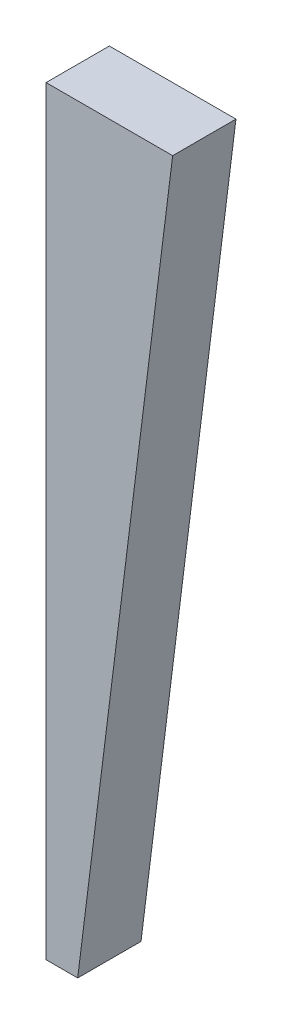
ISO-10303-21;
HEADER;
FILE_DESCRIPTION(('STEP AP214'),'2;1');
FILE_NAME('part.step','',(''),(''),'','','');
FILE_SCHEMA(('AUTOMOTIVE_DESIGN { 1 0 10303 214 1 1 1 1 }'));
ENDSEC;
DATA;
#1=APPLICATION_CONTEXT('core data for automotive mechanical design processes');
#2=APPLICATION_PROTOCOL_DEFINITION('international standard','automotive_design',2000,#1);
#3=PRODUCT_CONTEXT('',#1,'mechanical');
#4=PRODUCT('Part','Part','',(#3));
#5=PRODUCT_RELATED_PRODUCT_CATEGORY('part','',(#4));
#6=PRODUCT_DEFINITION_FORMATION('','',#4);
#7=PRODUCT_DEFINITION_CONTEXT('part definition',#1,'design');
#8=PRODUCT_DEFINITION('design','',#6,#7);
#9=PRODUCT_DEFINITION_SHAPE('','',#8);
#10=(LENGTH_UNIT() NAMED_UNIT(*) SI_UNIT(.MILLI.,.METRE.));
#11=(NAMED_UNIT(*) PLANE_ANGLE_UNIT() SI_UNIT($,.RADIAN.));
#12=(NAMED_UNIT(*) SI_UNIT($,.STERADIAN.) SOLID_ANGLE_UNIT());
#13=UNCERTAINTY_MEASURE_WITH_UNIT(LENGTH_MEASURE(1.E-05),#10,'distance_accuracy_value','');
#14=(GEOMETRIC_REPRESENTATION_CONTEXT(3) GLOBAL_UNCERTAINTY_ASSIGNED_CONTEXT((#13)) GLOBAL_UNIT_ASSIGNED_CONTEXT((#10,
#11,#12)) REPRESENTATION_CONTEXT('',''));
#15=CARTESIAN_POINT('',(0.,0.,0.));
#16=DIRECTION('',(0.,0.,1.));
#17=DIRECTION('',(1.,0.,0.));
#18=AXIS2_PLACEMENT_3D('',#15,#16,#17);
#19=CARTESIAN_POINT('',(0.,-76.2,6.35));
#20=DIRECTION('',(1.,0.,0.));
#21=DIRECTION('',(0.,0.,-1.));
#22=AXIS2_PLACEMENT_3D('',#19,#20,#21);
#23=PLANE('',#22);
#24=DIRECTION('',(0.,-1.,0.));
#25=VECTOR('',#24,1.);
#26=CARTESIAN_POINT('',(0.,-76.2,0.));
#27=LINE('',#26,#25);
#28=CARTESIAN_POINT('',(0.,0.,0.));
#29=VERTEX_POINT('',#28);
#30=CARTESIAN_POINT('',(0.,-76.2,0.));
#31=VERTEX_POINT('',#30);
#32=EDGE_CURVE('E96',#29,#31,#27,.T.);
#33=ORIENTED_EDGE('',*,*,#32,.T.);
#34=DIRECTION('',(0.,0.,-1.));
#35=VECTOR('',#34,1.);
#36=CARTESIAN_POINT('',(0.,-76.2,6.35));
#37=LINE('',#36,#35);
#38=CARTESIAN_POINT('',(0.,-76.2,6.35));
#39=VERTEX_POINT('',#38);
#40=EDGE_CURVE('E11',#39,#31,#37,.T.);
#41=ORIENTED_EDGE('',*,*,#40,.F.);
#42=DIRECTION('',(0.,-1.,0.));
#43=VECTOR('',#42,1.);
#44=CARTESIAN_POINT('',(0.,-76.2,6.35));
#45=LINE('',#44,#43);
#46=CARTESIAN_POINT('',(0.,0.,6.35));
#47=VERTEX_POINT('',#46);
#48=EDGE_CURVE('E84',#47,#39,#45,.T.);
#49=ORIENTED_EDGE('',*,*,#48,.F.);
#50=DIRECTION('',(0.,0.,-1.));
#51=VECTOR('',#50,1.);
#52=CARTESIAN_POINT('',(0.,0.,6.35));
#53=LINE('',#52,#51);
#54=EDGE_CURVE('E92',#47,#29,#53,.T.);
#55=ORIENTED_EDGE('',*,*,#54,.T.);
#56=EDGE_LOOP('',(#33,#41,#49,#55));
#57=FACE_BOUND('',#56,.T.);
#58=ADVANCED_FACE('F33',(#57),#23,.F.);
#59=CARTESIAN_POINT('',(3.175,-76.2,6.35));
#60=DIRECTION('',(0.,1.,0.));
#61=DIRECTION('',(0.,0.,1.));
#62=AXIS2_PLACEMENT_3D('',#59,#60,#61);
#63=PLANE('',#62);
#64=DIRECTION('',(1.,0.,0.));
#65=VECTOR('',#64,1.);
#66=CARTESIAN_POINT('',(3.175,-76.2,0.));
#67=LINE('',#66,#65);
#68=CARTESIAN_POINT('',(3.175,-76.2,0.));
#69=VERTEX_POINT('',#68);
#70=EDGE_CURVE('E88',#31,#69,#67,.T.);
#71=ORIENTED_EDGE('',*,*,#70,.T.);
#72=DIRECTION('',(0.,0.,-1.));
#73=VECTOR('',#72,1.);
#74=CARTESIAN_POINT('',(3.175,-76.2,6.35));
#75=LINE('',#74,#73);
#76=CARTESIAN_POINT('',(3.175,-76.2,6.35));
#77=VERTEX_POINT('',#76);
#78=EDGE_CURVE('E41',#77,#69,#75,.T.);
#79=ORIENTED_EDGE('',*,*,#78,.F.);
#80=DIRECTION('',(1.,0.,0.));
#81=VECTOR('',#80,1.);
#82=CARTESIAN_POINT('',(3.175,-76.2,6.35));
#83=LINE('',#82,#81);
#84=EDGE_CURVE('E79',#39,#77,#83,.T.);
#85=ORIENTED_EDGE('',*,*,#84,.F.);
#86=ORIENTED_EDGE('',*,*,#40,.T.);
#87=EDGE_LOOP('',(#71,#79,#85,#86));
#88=FACE_BOUND('',#87,.T.);
#89=ADVANCED_FACE('F87',(#88),#63,.F.);
#90=CARTESIAN_POINT('',(12.7,0.,6.35));
#91=DIRECTION('',(-0.992277876713668,0.124034734589208,0.));
#92=DIRECTION('',(-0.124034734589208,-0.992277876713668,0.));
#93=AXIS2_PLACEMENT_3D('',#90,#91,#92);
#94=PLANE('',#93);
#95=DIRECTION('',(0.124034734589208,0.992277876713668,0.));
#96=VECTOR('',#95,1.);
#97=CARTESIAN_POINT('',(12.7,0.,0.));
#98=LINE('',#97,#96);
#99=CARTESIAN_POINT('',(12.7,0.,0.));
#100=VERTEX_POINT('',#99);
#101=EDGE_CURVE('E66',#69,#100,#98,.T.);
#102=ORIENTED_EDGE('',*,*,#101,.T.);
#103=DIRECTION('',(0.,0.,-1.));
#104=VECTOR('',#103,1.);
#105=CARTESIAN_POINT('',(12.7,0.,6.35));
#106=LINE('',#105,#104);
#107=CARTESIAN_POINT('',(12.7,0.,6.35));
#108=VERTEX_POINT('',#107);
#109=EDGE_CURVE('E89',#108,#100,#106,.T.);
#110=ORIENTED_EDGE('',*,*,#109,.F.);
#111=DIRECTION('',(0.124034734589208,0.992277876713668,0.));
#112=VECTOR('',#111,1.);
#113=CARTESIAN_POINT('',(12.7,0.,6.35));
#114=LINE('',#113,#112);
#115=EDGE_CURVE('E82',#77,#108,#114,.T.);
#116=ORIENTED_EDGE('',*,*,#115,.F.);
#117=ORIENTED_EDGE('',*,*,#78,.T.);
#118=EDGE_LOOP('',(#102,#110,#116,#117));
#119=FACE_BOUND('',#118,.T.);
#120=ADVANCED_FACE('F90',(#119),#94,.F.);
#121=CARTESIAN_POINT('',(0.,0.,6.35));
#122=DIRECTION('',(0.,-1.,0.));
#123=DIRECTION('',(0.,0.,-1.));
#124=AXIS2_PLACEMENT_3D('',#121,#122,#123);
#125=PLANE('',#124);
#126=DIRECTION('',(-1.,0.,0.));
#127=VECTOR('',#126,1.);
#128=CARTESIAN_POINT('',(0.,0.,0.));
#129=LINE('',#128,#127);
#130=EDGE_CURVE('E72',#100,#29,#129,.T.);
#131=ORIENTED_EDGE('',*,*,#130,.T.);
#132=ORIENTED_EDGE('',*,*,#54,.F.);
#133=DIRECTION('',(-1.,0.,0.));
#134=VECTOR('',#133,1.);
#135=CARTESIAN_POINT('',(0.,0.,6.35));
#136=LINE('',#135,#134);
#137=EDGE_CURVE('E49',#108,#47,#136,.T.);
#138=ORIENTED_EDGE('',*,*,#137,.F.);
#139=ORIENTED_EDGE('',*,*,#109,.T.);
#140=EDGE_LOOP('',(#131,#132,#138,#139));
#141=FACE_BOUND('',#140,.T.);
#142=ADVANCED_FACE('F103',(#141),#125,.F.);
#143=CARTESIAN_POINT('',(0.,0.,6.35));
#144=DIRECTION('',(0.,0.,-1.));
#145=DIRECTION('',(-1.,0.,0.));
#146=AXIS2_PLACEMENT_3D('',#143,#144,#145);
#147=PLANE('',#146);
#148=ORIENTED_EDGE('',*,*,#48,.T.);
#149=ORIENTED_EDGE('',*,*,#84,.T.);
#150=ORIENTED_EDGE('',*,*,#115,.T.);
#151=ORIENTED_EDGE('',*,*,#137,.T.);
#152=EDGE_LOOP('',(#148,#149,#150,#151));
#153=FACE_BOUND('',#152,.T.);
#154=ADVANCED_FACE('F80',(#153),#147,.F.);
#155=CARTESIAN_POINT('',(0.,0.,0.));
#156=DIRECTION('',(0.,0.,-1.));
#157=DIRECTION('',(-1.,0.,0.));
#158=AXIS2_PLACEMENT_3D('',#155,#156,#157);
#159=PLANE('',#158);
#160=ORIENTED_EDGE('',*,*,#32,.F.);
#161=ORIENTED_EDGE('',*,*,#130,.F.);
#162=ORIENTED_EDGE('',*,*,#101,.F.);
#163=ORIENTED_EDGE('',*,*,#70,.F.);
#164=EDGE_LOOP('',(#160,#161,#162,#163));
#165=FACE_BOUND('',#164,.T.);
#166=ADVANCED_FACE('F106',(#165),#159,.T.);
#167=CLOSED_SHELL('',(#58,#89,#120,#142,#154,#166));
#168=MANIFOLD_SOLID_BREP('B2',#167);
#169=ADVANCED_BREP_SHAPE_REPRESENTATION('',(#18,#168),#14);
#170=SHAPE_DEFINITION_REPRESENTATION(#9,#169);
ENDSEC;
END-ISO-10303-21;
